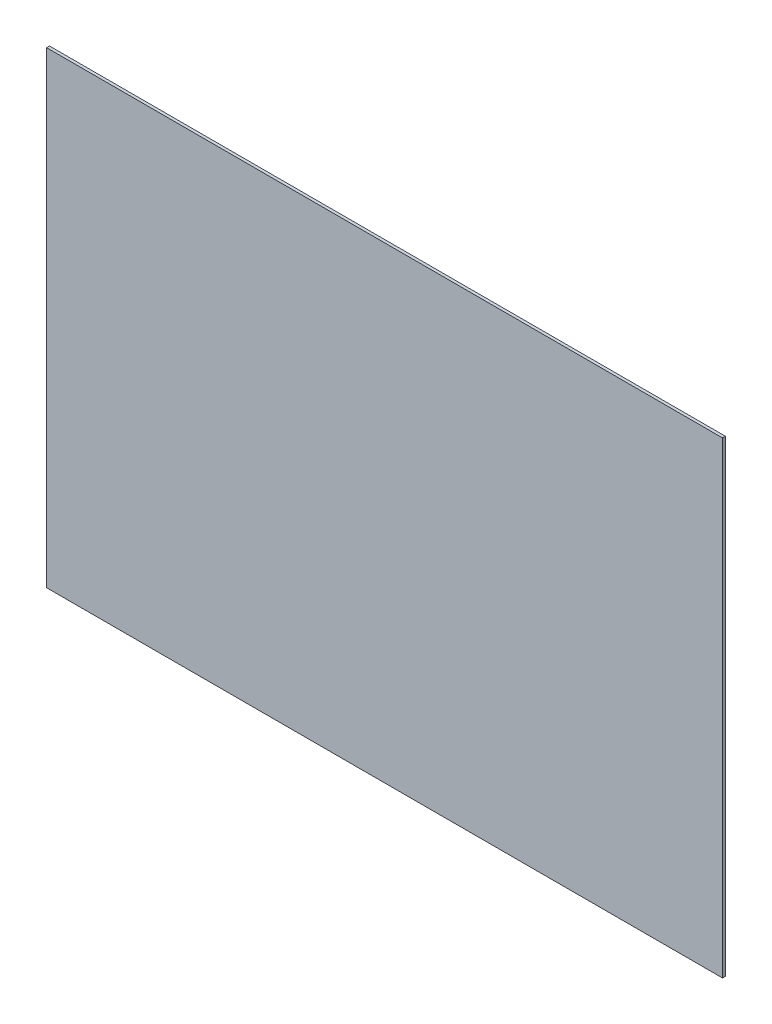
ISO-10303-21;
HEADER;
FILE_DESCRIPTION(('STEP AP214'),'2;1');
FILE_NAME('part.step','',(''),(''),'','','');
FILE_SCHEMA(('AUTOMOTIVE_DESIGN { 1 0 10303 214 1 1 1 1 }'));
ENDSEC;
DATA;
#1=APPLICATION_CONTEXT('core data for automotive mechanical design processes');
#2=APPLICATION_PROTOCOL_DEFINITION('international standard','automotive_design',2000,#1);
#3=PRODUCT_CONTEXT('',#1,'mechanical');
#4=PRODUCT('Part','Part','',(#3));
#5=PRODUCT_RELATED_PRODUCT_CATEGORY('part','',(#4));
#6=PRODUCT_DEFINITION_FORMATION('','',#4);
#7=PRODUCT_DEFINITION_CONTEXT('part definition',#1,'design');
#8=PRODUCT_DEFINITION('design','',#6,#7);
#9=PRODUCT_DEFINITION_SHAPE('','',#8);
#10=(LENGTH_UNIT() NAMED_UNIT(*) SI_UNIT(.MILLI.,.METRE.));
#11=(NAMED_UNIT(*) PLANE_ANGLE_UNIT() SI_UNIT($,.RADIAN.));
#12=(NAMED_UNIT(*) SI_UNIT($,.STERADIAN.) SOLID_ANGLE_UNIT());
#13=UNCERTAINTY_MEASURE_WITH_UNIT(LENGTH_MEASURE(1.E-05),#10,'distance_accuracy_value','');
#14=(GEOMETRIC_REPRESENTATION_CONTEXT(3) GLOBAL_UNCERTAINTY_ASSIGNED_CONTEXT((#13)) GLOBAL_UNIT_ASSIGNED_CONTEXT((#10,
#11,#12)) REPRESENTATION_CONTEXT('',''));
#15=CARTESIAN_POINT('',(0.,0.,0.));
#16=DIRECTION('',(0.,0.,1.));
#17=DIRECTION('',(1.,0.,0.));
#18=AXIS2_PLACEMENT_3D('',#15,#16,#17);
#19=CARTESIAN_POINT('',(372.5,257.8,3.175));
#20=DIRECTION('',(-1.,0.,0.));
#21=DIRECTION('',(0.,-1.,0.));
#22=AXIS2_PLACEMENT_3D('',#19,#20,#21);
#23=PLANE('',#22);
#24=DIRECTION('',(0.,1.,0.));
#25=VECTOR('',#24,1.);
#26=CARTESIAN_POINT('',(372.5,257.8,0.));
#27=LINE('',#26,#25);
#28=CARTESIAN_POINT('',(372.5,-257.8,0.));
#29=VERTEX_POINT('',#28);
#30=CARTESIAN_POINT('',(372.5,257.8,0.));
#31=VERTEX_POINT('',#30);
#32=EDGE_CURVE('E102',#29,#31,#27,.T.);
#33=ORIENTED_EDGE('',*,*,#32,.T.);
#34=DIRECTION('',(0.,0.,-1.));
#35=VECTOR('',#34,1.);
#36=CARTESIAN_POINT('',(372.5,257.8,3.175));
#37=LINE('',#36,#35);
#38=CARTESIAN_POINT('',(372.5,257.8,3.175));
#39=VERTEX_POINT('',#38);
#40=EDGE_CURVE('E11',#39,#31,#37,.T.);
#41=ORIENTED_EDGE('',*,*,#40,.F.);
#42=DIRECTION('',(0.,1.,0.));
#43=VECTOR('',#42,1.);
#44=CARTESIAN_POINT('',(372.5,257.8,3.175));
#45=LINE('',#44,#43);
#46=CARTESIAN_POINT('',(372.5,-257.8,3.175));
#47=VERTEX_POINT('',#46);
#48=EDGE_CURVE('E90',#47,#39,#45,.T.);
#49=ORIENTED_EDGE('',*,*,#48,.F.);
#50=DIRECTION('',(0.,0.,-1.));
#51=VECTOR('',#50,1.);
#52=CARTESIAN_POINT('',(372.5,-257.8,3.175));
#53=LINE('',#52,#51);
#54=EDGE_CURVE('E98',#47,#29,#53,.T.);
#55=ORIENTED_EDGE('',*,*,#54,.T.);
#56=EDGE_LOOP('',(#33,#41,#49,#55));
#57=FACE_BOUND('',#56,.T.);
#58=ADVANCED_FACE('F39',(#57),#23,.F.);
#59=CARTESIAN_POINT('',(-372.5,257.8,3.175));
#60=DIRECTION('',(0.,-1.,0.));
#61=DIRECTION('',(0.,0.,-1.));
#62=AXIS2_PLACEMENT_3D('',#59,#60,#61);
#63=PLANE('',#62);
#64=DIRECTION('',(-1.,0.,0.));
#65=VECTOR('',#64,1.);
#66=CARTESIAN_POINT('',(-372.5,257.8,0.));
#67=LINE('',#66,#65);
#68=CARTESIAN_POINT('',(-372.5,257.8,0.));
#69=VERTEX_POINT('',#68);
#70=EDGE_CURVE('E94',#31,#69,#67,.T.);
#71=ORIENTED_EDGE('',*,*,#70,.T.);
#72=DIRECTION('',(0.,0.,-1.));
#73=VECTOR('',#72,1.);
#74=CARTESIAN_POINT('',(-372.5,257.8,3.175));
#75=LINE('',#74,#73);
#76=CARTESIAN_POINT('',(-372.5,257.8,3.175));
#77=VERTEX_POINT('',#76);
#78=EDGE_CURVE('E47',#77,#69,#75,.T.);
#79=ORIENTED_EDGE('',*,*,#78,.F.);
#80=DIRECTION('',(-1.,0.,0.));
#81=VECTOR('',#80,1.);
#82=CARTESIAN_POINT('',(-372.5,257.8,3.175));
#83=LINE('',#82,#81);
#84=EDGE_CURVE('E85',#39,#77,#83,.T.);
#85=ORIENTED_EDGE('',*,*,#84,.F.);
#86=ORIENTED_EDGE('',*,*,#40,.T.);
#87=EDGE_LOOP('',(#71,#79,#85,#86));
#88=FACE_BOUND('',#87,.T.);
#89=ADVANCED_FACE('F93',(#88),#63,.F.);
#90=CARTESIAN_POINT('',(-372.5,257.8,3.175));
#91=DIRECTION('',(1.,0.,0.));
#92=DIRECTION('',(0.,1.,0.));
#93=AXIS2_PLACEMENT_3D('',#90,#91,#92);
#94=PLANE('',#93);
#95=DIRECTION('',(0.,-1.,0.));
#96=VECTOR('',#95,1.);
#97=CARTESIAN_POINT('',(-372.5,257.8,0.));
#98=LINE('',#97,#96);
#99=CARTESIAN_POINT('',(-372.5,-257.8,0.));
#100=VERTEX_POINT('',#99);
#101=EDGE_CURVE('E72',#69,#100,#98,.T.);
#102=ORIENTED_EDGE('',*,*,#101,.T.);
#103=DIRECTION('',(0.,0.,-1.));
#104=VECTOR('',#103,1.);
#105=CARTESIAN_POINT('',(-372.5,-257.8,3.175));
#106=LINE('',#105,#104);
#107=CARTESIAN_POINT('',(-372.5,-257.8,3.175));
#108=VERTEX_POINT('',#107);
#109=EDGE_CURVE('E95',#108,#100,#106,.T.);
#110=ORIENTED_EDGE('',*,*,#109,.F.);
#111=DIRECTION('',(0.,-1.,0.));
#112=VECTOR('',#111,1.);
#113=CARTESIAN_POINT('',(-372.5,257.8,3.175));
#114=LINE('',#113,#112);
#115=EDGE_CURVE('E88',#77,#108,#114,.T.);
#116=ORIENTED_EDGE('',*,*,#115,.F.);
#117=ORIENTED_EDGE('',*,*,#78,.T.);
#118=EDGE_LOOP('',(#102,#110,#116,#117));
#119=FACE_BOUND('',#118,.T.);
#120=ADVANCED_FACE('F96',(#119),#94,.F.);
#121=CARTESIAN_POINT('',(-372.5,-257.8,3.175));
#122=DIRECTION('',(0.,1.,0.));
#123=DIRECTION('',(0.,0.,1.));
#124=AXIS2_PLACEMENT_3D('',#121,#122,#123);
#125=PLANE('',#124);
#126=DIRECTION('',(1.,0.,0.));
#127=VECTOR('',#126,1.);
#128=CARTESIAN_POINT('',(-372.5,-257.8,0.));
#129=LINE('',#128,#127);
#130=EDGE_CURVE('E78',#100,#29,#129,.T.);
#131=ORIENTED_EDGE('',*,*,#130,.T.);
#132=ORIENTED_EDGE('',*,*,#54,.F.);
#133=DIRECTION('',(1.,0.,0.));
#134=VECTOR('',#133,1.);
#135=CARTESIAN_POINT('',(-372.5,-257.8,3.175));
#136=LINE('',#135,#134);
#137=EDGE_CURVE('E55',#108,#47,#136,.T.);
#138=ORIENTED_EDGE('',*,*,#137,.F.);
#139=ORIENTED_EDGE('',*,*,#109,.T.);
#140=EDGE_LOOP('',(#131,#132,#138,#139));
#141=FACE_BOUND('',#140,.T.);
#142=ADVANCED_FACE('F109',(#141),#125,.F.);
#143=CARTESIAN_POINT('',(0.,0.,3.175));
#144=DIRECTION('',(0.,0.,1.));
#145=DIRECTION('',(1.,0.,0.));
#146=AXIS2_PLACEMENT_3D('',#143,#144,#145);
#147=PLANE('',#146);
#148=ORIENTED_EDGE('',*,*,#48,.T.);
#149=ORIENTED_EDGE('',*,*,#84,.T.);
#150=ORIENTED_EDGE('',*,*,#115,.T.);
#151=ORIENTED_EDGE('',*,*,#137,.T.);
#152=EDGE_LOOP('',(#148,#149,#150,#151));
#153=FACE_BOUND('',#152,.T.);
#154=ADVANCED_FACE('F86',(#153),#147,.T.);
#155=CARTESIAN_POINT('',(0.,0.,0.));
#156=DIRECTION('',(0.,0.,1.));
#157=DIRECTION('',(1.,0.,0.));
#158=AXIS2_PLACEMENT_3D('',#155,#156,#157);
#159=PLANE('',#158);
#160=ORIENTED_EDGE('',*,*,#32,.F.);
#161=ORIENTED_EDGE('',*,*,#130,.F.);
#162=ORIENTED_EDGE('',*,*,#101,.F.);
#163=ORIENTED_EDGE('',*,*,#70,.F.);
#164=EDGE_LOOP('',(#160,#161,#162,#163));
#165=FACE_BOUND('',#164,.T.);
#166=ADVANCED_FACE('F112',(#165),#159,.F.);
#167=CLOSED_SHELL('',(#58,#89,#120,#142,#154,#166));
#168=MANIFOLD_SOLID_BREP('B2',#167);
#169=ADVANCED_BREP_SHAPE_REPRESENTATION('',(#18,#168),#14);
#170=SHAPE_DEFINITION_REPRESENTATION(#9,#169);
ENDSEC;
END-ISO-10303-21;
